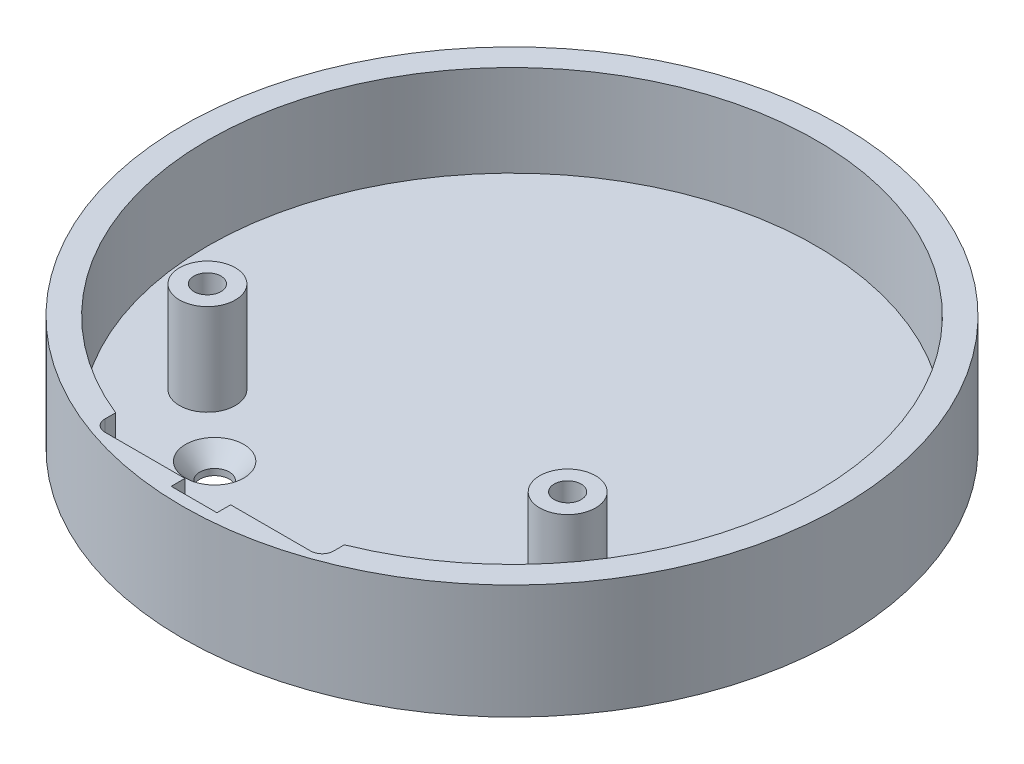
ISO-10303-21;
HEADER;
FILE_DESCRIPTION(('STEP AP214'),'2;1');
FILE_NAME('part.step','',(''),(''),'','','');
FILE_SCHEMA(('AUTOMOTIVE_DESIGN { 1 0 10303 214 1 1 1 1 }'));
ENDSEC;
DATA;
#1=APPLICATION_CONTEXT('core data for automotive mechanical design processes');
#2=APPLICATION_PROTOCOL_DEFINITION('international standard','automotive_design',2000,#1);
#3=PRODUCT_CONTEXT('',#1,'mechanical');
#4=PRODUCT('Part','Part','',(#3));
#5=PRODUCT_RELATED_PRODUCT_CATEGORY('part','',(#4));
#6=PRODUCT_DEFINITION_FORMATION('','',#4);
#7=PRODUCT_DEFINITION_CONTEXT('part definition',#1,'design');
#8=PRODUCT_DEFINITION('design','',#6,#7);
#9=PRODUCT_DEFINITION_SHAPE('','',#8);
#10=(LENGTH_UNIT() NAMED_UNIT(*) SI_UNIT(.MILLI.,.METRE.));
#11=(NAMED_UNIT(*) PLANE_ANGLE_UNIT() SI_UNIT($,.RADIAN.));
#12=(NAMED_UNIT(*) SI_UNIT($,.STERADIAN.) SOLID_ANGLE_UNIT());
#13=UNCERTAINTY_MEASURE_WITH_UNIT(LENGTH_MEASURE(1.E-05),#10,'distance_accuracy_value','');
#14=(GEOMETRIC_REPRESENTATION_CONTEXT(3) GLOBAL_UNCERTAINTY_ASSIGNED_CONTEXT((#13)) GLOBAL_UNIT_ASSIGNED_CONTEXT((#10,
#11,#12)) REPRESENTATION_CONTEXT('',''));
#15=CARTESIAN_POINT('',(0.,0.,0.));
#16=DIRECTION('',(0.,0.,1.));
#17=DIRECTION('',(1.,0.,0.));
#18=AXIS2_PLACEMENT_3D('',#15,#16,#17);
#19=CARTESIAN_POINT('',(-12.7,2.54,33.782));
#20=DIRECTION('',(0.,0.,-1.));
#21=DIRECTION('',(-1.,0.,0.));
#22=AXIS2_PLACEMENT_3D('',#19,#20,#21);
#23=PLANE('',#22);
#24=DIRECTION('',(1.,0.,0.));
#25=VECTOR('',#24,1.);
#26=CARTESIAN_POINT('',(-12.7,0.,33.782));
#27=LINE('',#26,#25);
#28=CARTESIAN_POINT('',(-11.43,0.,33.782));
#29=VERTEX_POINT('',#28);
#30=CARTESIAN_POINT('',(-2.54,0.,33.782));
#31=VERTEX_POINT('',#30);
#32=EDGE_CURVE('E185',#29,#31,#27,.T.);
#33=ORIENTED_EDGE('',*,*,#32,.F.);
#34=DIRECTION('',(0.,-1.,0.));
#35=VECTOR('',#34,1.);
#36=CARTESIAN_POINT('',(-11.43,12.7,33.782));
#37=LINE('',#36,#35);
#38=CARTESIAN_POINT('',(-11.43,12.7,33.782));
#39=VERTEX_POINT('',#38);
#40=EDGE_CURVE('E228',#29,#39,#37,.F.);
#41=ORIENTED_EDGE('',*,*,#40,.T.);
#42=DIRECTION('',(-1.,0.,0.));
#43=VECTOR('',#42,1.);
#44=CARTESIAN_POINT('',(-12.7,12.7,33.782));
#45=LINE('',#44,#43);
#46=CARTESIAN_POINT('',(-2.54,12.7,33.782));
#47=VERTEX_POINT('',#46);
#48=EDGE_CURVE('E305',#47,#39,#45,.T.);
#49=ORIENTED_EDGE('',*,*,#48,.F.);
#50=DIRECTION('',(0.,-1.,0.));
#51=VECTOR('',#50,1.);
#52=CARTESIAN_POINT('',(-2.54,12.7,33.782));
#53=LINE('',#52,#51);
#54=EDGE_CURVE('E316',#47,#31,#53,.T.);
#55=ORIENTED_EDGE('',*,*,#54,.T.);
#56=EDGE_LOOP('',(#33,#41,#49,#55));
#57=FACE_BOUND('',#56,.T.);
#58=ADVANCED_FACE('F45',(#57),#23,.T.);
#59=CARTESIAN_POINT('',(0.,2.54,0.));
#60=DIRECTION('',(0.,1.,0.));
#61=DIRECTION('',(0.,0.,1.));
#62=AXIS2_PLACEMENT_3D('',#59,#60,#61);
#63=PLANE('',#62);
#64=CARTESIAN_POINT('',(-12.7,2.54,20.32));
#65=DIRECTION('',(0.,1.,0.));
#66=DIRECTION('',(0.,0.,1.));
#67=AXIS2_PLACEMENT_3D('',#64,#65,#66);
#68=CIRCLE('',#67,3.2385);
#69=CARTESIAN_POINT('',(-12.7,2.54,23.5585));
#70=VERTEX_POINT('',#69);
#71=EDGE_CURVE('E322',#70,#70,#68,.T.);
#72=ORIENTED_EDGE('',*,*,#71,.F.);
#73=EDGE_LOOP('',(#72));
#74=FACE_BOUND('',#73,.T.);
#75=CARTESIAN_POINT('',(12.7,2.54,20.32));
#76=DIRECTION('',(0.,1.,0.));
#77=DIRECTION('',(0.,0.,1.));
#78=AXIS2_PLACEMENT_3D('',#75,#76,#77);
#79=CIRCLE('',#78,3.2385);
#80=CARTESIAN_POINT('',(12.7,2.54,23.5585));
#81=VERTEX_POINT('',#80);
#82=EDGE_CURVE('E364',#81,#81,#79,.T.);
#83=ORIENTED_EDGE('',*,*,#82,.F.);
#84=EDGE_LOOP('',(#83));
#85=FACE_BOUND('',#84,.T.);
#86=CARTESIAN_POINT('',(20.,2.54,13.82014));
#87=DIRECTION('',(0.,1.,0.));
#88=DIRECTION('',(0.,0.,1.));
#89=AXIS2_PLACEMENT_3D('',#86,#87,#88);
#90=CIRCLE('',#89,3.0999968);
#91=CARTESIAN_POINT('',(20.,2.54,16.9201368));
#92=VERTEX_POINT('',#91);
#93=EDGE_CURVE('E381',#92,#92,#90,.T.);
#94=ORIENTED_EDGE('',*,*,#93,.F.);
#95=EDGE_LOOP('',(#94));
#96=FACE_BOUND('',#95,.T.);
#97=CARTESIAN_POINT('',(-20.,2.54,13.82014));
#98=DIRECTION('',(0.,1.,0.));
#99=DIRECTION('',(0.,0.,1.));
#100=AXIS2_PLACEMENT_3D('',#97,#98,#99);
#101=CIRCLE('',#100,3.0999968);
#102=CARTESIAN_POINT('',(-20.,2.54,16.9201368));
#103=VERTEX_POINT('',#102);
#104=EDGE_CURVE('E293',#103,#103,#101,.T.);
#105=ORIENTED_EDGE('',*,*,#104,.F.);
#106=EDGE_LOOP('',(#105));
#107=FACE_BOUND('',#106,.T.);
#108=DIRECTION('',(0.,0.,-1.));
#109=VECTOR('',#108,1.);
#110=CARTESIAN_POINT('',(12.7,2.54,25.527));
#111=LINE('',#110,#109);
#112=CARTESIAN_POINT('',(12.7,2.54,31.3178106835392));
#113=VERTEX_POINT('',#112);
#114=CARTESIAN_POINT('',(12.7,2.54,26.797));
#115=VERTEX_POINT('',#114);
#116=EDGE_CURVE('E204',#113,#115,#111,.T.);
#117=ORIENTED_EDGE('',*,*,#116,.F.);
#118=CARTESIAN_POINT('',(0.,2.54,0.));
#119=DIRECTION('',(0.,1.,0.));
#120=DIRECTION('',(0.,0.,1.));
#121=AXIS2_PLACEMENT_3D('',#118,#119,#120);
#122=CIRCLE('',#121,33.7949);
#123=CARTESIAN_POINT('',(-12.7,2.54,31.3178106835392));
#124=VERTEX_POINT('',#123);
#125=EDGE_CURVE('E203',#113,#124,#122,.T.);
#126=ORIENTED_EDGE('',*,*,#125,.T.);
#127=DIRECTION('',(0.,0.,1.));
#128=VECTOR('',#127,1.);
#129=CARTESIAN_POINT('',(-12.7,2.54,25.527));
#130=LINE('',#129,#128);
#131=CARTESIAN_POINT('',(-12.7,2.54,26.797));
#132=VERTEX_POINT('',#131);
#133=EDGE_CURVE('E267',#132,#124,#130,.T.);
#134=ORIENTED_EDGE('',*,*,#133,.F.);
#135=CARTESIAN_POINT('',(-11.43,2.54,26.797));
#136=DIRECTION('',(0.,1.,0.));
#137=DIRECTION('',(0.,0.,1.));
#138=AXIS2_PLACEMENT_3D('',#135,#136,#137);
#139=CIRCLE('',#138,1.27);
#140=CARTESIAN_POINT('',(-11.43,2.54,25.527));
#141=VERTEX_POINT('',#140);
#142=EDGE_CURVE('E11',#132,#141,#139,.F.);
#143=ORIENTED_EDGE('',*,*,#142,.T.);
#144=DIRECTION('',(-1.,0.,0.));
#145=VECTOR('',#144,1.);
#146=CARTESIAN_POINT('',(-12.7,2.54,25.527));
#147=LINE('',#146,#145);
#148=CARTESIAN_POINT('',(11.43,2.54,25.527));
#149=VERTEX_POINT('',#148);
#150=EDGE_CURVE('E198',#149,#141,#147,.T.);
#151=ORIENTED_EDGE('',*,*,#150,.F.);
#152=CARTESIAN_POINT('',(11.43,2.54,26.797));
#153=DIRECTION('',(0.,1.,0.));
#154=DIRECTION('',(0.,0.,1.));
#155=AXIS2_PLACEMENT_3D('',#152,#153,#154);
#156=CIRCLE('',#155,1.27);
#157=EDGE_CURVE('E252',#149,#115,#156,.F.);
#158=ORIENTED_EDGE('',*,*,#157,.T.);
#159=EDGE_LOOP('',(#117,#126,#134,#143,#151,#158));
#160=FACE_BOUND('',#159,.T.);
#161=ADVANCED_FACE('F300',(#74,#85,#96,#107,#160),#63,.T.);
#162=CARTESIAN_POINT('',(0.,0.,0.));
#163=DIRECTION('',(0.,1.,0.));
#164=DIRECTION('',(0.,0.,1.));
#165=AXIS2_PLACEMENT_3D('',#162,#163,#164);
#166=PLANE('',#165);
#167=CARTESIAN_POINT('',(-12.7,0.,20.32));
#168=DIRECTION('',(0.,1.,0.));
#169=DIRECTION('',(0.,0.,1.));
#170=AXIS2_PLACEMENT_3D('',#167,#168,#169);
#171=CIRCLE('',#170,1.63195);
#172=CARTESIAN_POINT('',(-12.7,0.,21.95195));
#173=VERTEX_POINT('',#172);
#174=EDGE_CURVE('E360',#173,#173,#171,.T.);
#175=ORIENTED_EDGE('',*,*,#174,.T.);
#176=EDGE_LOOP('',(#175));
#177=FACE_BOUND('',#176,.T.);
#178=CARTESIAN_POINT('',(12.7,0.,20.32));
#179=DIRECTION('',(0.,1.,0.));
#180=DIRECTION('',(0.,0.,1.));
#181=AXIS2_PLACEMENT_3D('',#178,#179,#180);
#182=CIRCLE('',#181,1.63195);
#183=CARTESIAN_POINT('',(12.7,0.,21.95195));
#184=VERTEX_POINT('',#183);
#185=EDGE_CURVE('E372',#184,#184,#182,.T.);
#186=ORIENTED_EDGE('',*,*,#185,.T.);
#187=EDGE_LOOP('',(#186));
#188=FACE_BOUND('',#187,.T.);
#189=CARTESIAN_POINT('',(20.,0.,13.82014));
#190=DIRECTION('',(0.,1.,0.));
#191=DIRECTION('',(0.,0.,1.));
#192=AXIS2_PLACEMENT_3D('',#189,#190,#191);
#193=CIRCLE('',#192,1.5);
#194=CARTESIAN_POINT('',(20.,0.,15.32014));
#195=VERTEX_POINT('',#194);
#196=EDGE_CURVE('E377',#195,#195,#193,.T.);
#197=ORIENTED_EDGE('',*,*,#196,.T.);
#198=EDGE_LOOP('',(#197));
#199=FACE_BOUND('',#198,.T.);
#200=CARTESIAN_POINT('',(-20.,0.,13.82014));
#201=DIRECTION('',(0.,1.,0.));
#202=DIRECTION('',(0.,0.,1.));
#203=AXIS2_PLACEMENT_3D('',#200,#201,#202);
#204=CIRCLE('',#203,1.5);
#205=CARTESIAN_POINT('',(-20.,0.,15.32014));
#206=VERTEX_POINT('',#205);
#207=EDGE_CURVE('E386',#206,#206,#204,.T.);
#208=ORIENTED_EDGE('',*,*,#207,.T.);
#209=EDGE_LOOP('',(#208));
#210=FACE_BOUND('',#209,.T.);
#211=CARTESIAN_POINT('',(0.,0.,0.));
#212=DIRECTION('',(0.,1.,0.));
#213=DIRECTION('',(0.,0.,1.));
#214=AXIS2_PLACEMENT_3D('',#211,#212,#213);
#215=CIRCLE('',#214,36.5949);
#216=CARTESIAN_POINT('',(0.,0.,36.5949));
#217=VERTEX_POINT('',#216);
#218=EDGE_CURVE('E199',#217,#217,#215,.T.);
#219=ORIENTED_EDGE('',*,*,#218,.F.);
#220=EDGE_LOOP('',(#219));
#221=FACE_BOUND('',#220,.T.);
#222=DIRECTION('',(0.,0.,1.));
#223=VECTOR('',#222,1.);
#224=CARTESIAN_POINT('',(-12.7,0.,25.527));
#225=LINE('',#224,#223);
#226=CARTESIAN_POINT('',(-12.7,0.,26.797));
#227=VERTEX_POINT('',#226);
#228=CARTESIAN_POINT('',(-12.7,0.,32.512));
#229=VERTEX_POINT('',#228);
#230=EDGE_CURVE('E186',#227,#229,#225,.T.);
#231=ORIENTED_EDGE('',*,*,#230,.T.);
#232=CARTESIAN_POINT('',(-11.43,0.,32.512));
#233=DIRECTION('',(0.,1.,0.));
#234=DIRECTION('',(0.,0.,1.));
#235=AXIS2_PLACEMENT_3D('',#232,#233,#234);
#236=CIRCLE('',#235,1.27);
#237=EDGE_CURVE('E243',#229,#29,#236,.T.);
#238=ORIENTED_EDGE('',*,*,#237,.T.);
#239=ORIENTED_EDGE('',*,*,#32,.T.);
#240=DIRECTION('',(0.,0.,-1.));
#241=VECTOR('',#240,1.);
#242=CARTESIAN_POINT('',(-2.54,0.,35.3036449394393));
#243=LINE('',#242,#241);
#244=CARTESIAN_POINT('',(-2.54,0.,35.3036449394393));
#245=VERTEX_POINT('',#244);
#246=EDGE_CURVE('E325',#245,#31,#243,.T.);
#247=ORIENTED_EDGE('',*,*,#246,.F.);
#248=DIRECTION('',(-1.,0.,0.));
#249=VECTOR('',#248,1.);
#250=CARTESIAN_POINT('',(-2.54,0.,35.3036449394393));
#251=LINE('',#250,#249);
#252=CARTESIAN_POINT('',(2.54,0.,35.3036449394393));
#253=VERTEX_POINT('',#252);
#254=EDGE_CURVE('E177',#253,#245,#251,.T.);
#255=ORIENTED_EDGE('',*,*,#254,.F.);
#256=DIRECTION('',(0.,0.,1.));
#257=VECTOR('',#256,1.);
#258=CARTESIAN_POINT('',(2.54,0.,35.3036449394393));
#259=LINE('',#258,#257);
#260=CARTESIAN_POINT('',(2.54,0.,33.782));
#261=VERTEX_POINT('',#260);
#262=EDGE_CURVE('E159',#261,#253,#259,.T.);
#263=ORIENTED_EDGE('',*,*,#262,.F.);
#264=CARTESIAN_POINT('',(11.43,0.,33.782));
#265=VERTEX_POINT('',#264);
#266=EDGE_CURVE('E174',#261,#265,#27,.T.);
#267=ORIENTED_EDGE('',*,*,#266,.T.);
#268=CARTESIAN_POINT('',(11.43,0.,32.512));
#269=DIRECTION('',(0.,1.,0.));
#270=DIRECTION('',(0.,0.,1.));
#271=AXIS2_PLACEMENT_3D('',#268,#269,#270);
#272=CIRCLE('',#271,1.27);
#273=CARTESIAN_POINT('',(12.7,0.,32.512));
#274=VERTEX_POINT('',#273);
#275=EDGE_CURVE('E237',#265,#274,#272,.T.);
#276=ORIENTED_EDGE('',*,*,#275,.T.);
#277=DIRECTION('',(0.,0.,-1.));
#278=VECTOR('',#277,1.);
#279=CARTESIAN_POINT('',(12.7,0.,25.527));
#280=LINE('',#279,#278);
#281=CARTESIAN_POINT('',(12.7,0.,26.797));
#282=VERTEX_POINT('',#281);
#283=EDGE_CURVE('E190',#274,#282,#280,.T.);
#284=ORIENTED_EDGE('',*,*,#283,.T.);
#285=CARTESIAN_POINT('',(11.43,0.,26.797));
#286=DIRECTION('',(0.,1.,0.));
#287=DIRECTION('',(0.,0.,1.));
#288=AXIS2_PLACEMENT_3D('',#285,#286,#287);
#289=CIRCLE('',#288,1.27);
#290=CARTESIAN_POINT('',(11.43,0.,25.527));
#291=VERTEX_POINT('',#290);
#292=EDGE_CURVE('E249',#282,#291,#289,.T.);
#293=ORIENTED_EDGE('',*,*,#292,.T.);
#294=DIRECTION('',(-1.,0.,0.));
#295=VECTOR('',#294,1.);
#296=CARTESIAN_POINT('',(-12.7,0.,25.527));
#297=LINE('',#296,#295);
#298=CARTESIAN_POINT('',(-11.43,0.,25.527));
#299=VERTEX_POINT('',#298);
#300=EDGE_CURVE('E191',#291,#299,#297,.T.);
#301=ORIENTED_EDGE('',*,*,#300,.T.);
#302=CARTESIAN_POINT('',(-11.43,0.,26.797));
#303=DIRECTION('',(0.,1.,0.));
#304=DIRECTION('',(0.,0.,1.));
#305=AXIS2_PLACEMENT_3D('',#302,#303,#304);
#306=CIRCLE('',#305,1.27);
#307=EDGE_CURVE('E54',#299,#227,#306,.T.);
#308=ORIENTED_EDGE('',*,*,#307,.T.);
#309=EDGE_LOOP('',(#231,#238,#239,#247,#255,#263,#267,#276,#284,#293,#301,#308));
#310=FACE_BOUND('',#309,.T.);
#311=ADVANCED_FACE('F173',(#177,#188,#199,#210,#221,#310),#166,.F.);
#312=CARTESIAN_POINT('',(0.,2.54,0.));
#313=DIRECTION('',(0.,-1.,0.));
#314=DIRECTION('',(0.,0.,-1.));
#315=AXIS2_PLACEMENT_3D('',#312,#313,#314);
#316=CYLINDRICAL_SURFACE('',#315,36.5949);
#317=ORIENTED_EDGE('',*,*,#218,.T.);
#318=EDGE_LOOP('',(#317));
#319=FACE_BOUND('',#318,.T.);
#320=CARTESIAN_POINT('',(0.,12.7,0.));
#321=DIRECTION('',(0.,1.,0.));
#322=DIRECTION('',(0.,0.,1.));
#323=AXIS2_PLACEMENT_3D('',#320,#321,#322);
#324=CIRCLE('',#323,36.5949);
#325=CARTESIAN_POINT('',(0.,12.7,36.5949));
#326=VERTEX_POINT('',#325);
#327=EDGE_CURVE('E272',#326,#326,#324,.T.);
#328=ORIENTED_EDGE('',*,*,#327,.F.);
#329=EDGE_LOOP('',(#328));
#330=FACE_BOUND('',#329,.T.);
#331=ADVANCED_FACE('F413',(#319,#330),#316,.T.);
#332=CARTESIAN_POINT('',(-12.7,2.54,25.527));
#333=DIRECTION('',(0.,0.,1.));
#334=DIRECTION('',(1.,0.,0.));
#335=AXIS2_PLACEMENT_3D('',#332,#333,#334);
#336=PLANE('',#335);
#337=ORIENTED_EDGE('',*,*,#300,.F.);
#338=DIRECTION('',(0.,-1.,0.));
#339=VECTOR('',#338,1.);
#340=CARTESIAN_POINT('',(11.43,2.54,25.527));
#341=LINE('',#340,#339);
#342=EDGE_CURVE('E66',#291,#149,#341,.F.);
#343=ORIENTED_EDGE('',*,*,#342,.T.);
#344=ORIENTED_EDGE('',*,*,#150,.T.);
#345=DIRECTION('',(0.,-1.,0.));
#346=VECTOR('',#345,1.);
#347=CARTESIAN_POINT('',(-11.43,0.,25.527));
#348=LINE('',#347,#346);
#349=EDGE_CURVE('E231',#141,#299,#348,.T.);
#350=ORIENTED_EDGE('',*,*,#349,.T.);
#351=EDGE_LOOP('',(#337,#343,#344,#350));
#352=FACE_BOUND('',#351,.T.);
#353=ADVANCED_FACE('F264',(#352),#336,.T.);
#354=CARTESIAN_POINT('',(-12.7,2.54,25.527));
#355=DIRECTION('',(1.,0.,0.));
#356=DIRECTION('',(0.,0.,-1.));
#357=AXIS2_PLACEMENT_3D('',#354,#355,#356);
#358=PLANE('',#357);
#359=DIRECTION('',(0.,0.,-1.));
#360=VECTOR('',#359,1.);
#361=CARTESIAN_POINT('',(-12.7,12.7,25.527));
#362=LINE('',#361,#360);
#363=CARTESIAN_POINT('',(-12.7,12.7,32.512));
#364=VERTEX_POINT('',#363);
#365=CARTESIAN_POINT('',(-12.7,12.7,31.3178106835392));
#366=VERTEX_POINT('',#365);
#367=EDGE_CURVE('E302',#364,#366,#362,.T.);
#368=ORIENTED_EDGE('',*,*,#367,.F.);
#369=DIRECTION('',(0.,-1.,0.));
#370=VECTOR('',#369,1.);
#371=CARTESIAN_POINT('',(-12.7,0.,32.512));
#372=LINE('',#371,#370);
#373=EDGE_CURVE('E224',#364,#229,#372,.T.);
#374=ORIENTED_EDGE('',*,*,#373,.T.);
#375=ORIENTED_EDGE('',*,*,#230,.F.);
#376=DIRECTION('',(0.,-1.,0.));
#377=VECTOR('',#376,1.);
#378=CARTESIAN_POINT('',(-12.7,2.54,26.797));
#379=LINE('',#378,#377);
#380=EDGE_CURVE('E221',#227,#132,#379,.F.);
#381=ORIENTED_EDGE('',*,*,#380,.T.);
#382=ORIENTED_EDGE('',*,*,#133,.T.);
#383=DIRECTION('',(0.,-1.,0.));
#384=VECTOR('',#383,1.);
#385=CARTESIAN_POINT('',(-12.7,12.7,31.3178106835392));
#386=LINE('',#385,#384);
#387=EDGE_CURVE('E205',#124,#366,#386,.F.);
#388=ORIENTED_EDGE('',*,*,#387,.T.);
#389=EDGE_LOOP('',(#368,#374,#375,#381,#382,#388));
#390=FACE_BOUND('',#389,.T.);
#391=ADVANCED_FACE('F262',(#390),#358,.T.);
#392=DIRECTION('',(-1.,0.,0.));
#393=VECTOR('',#392,1.);
#394=CARTESIAN_POINT('',(2.54,12.7,33.782));
#395=LINE('',#394,#393);
#396=CARTESIAN_POINT('',(11.43,12.7,33.782));
#397=VERTEX_POINT('',#396);
#398=CARTESIAN_POINT('',(2.54,12.7,33.782));
#399=VERTEX_POINT('',#398);
#400=EDGE_CURVE('E328',#397,#399,#395,.T.);
#401=ORIENTED_EDGE('',*,*,#400,.F.);
#402=DIRECTION('',(0.,-1.,0.));
#403=VECTOR('',#402,1.);
#404=CARTESIAN_POINT('',(11.43,0.,33.782));
#405=LINE('',#404,#403);
#406=EDGE_CURVE('E183',#397,#265,#405,.T.);
#407=ORIENTED_EDGE('',*,*,#406,.T.);
#408=ORIENTED_EDGE('',*,*,#266,.F.);
#409=DIRECTION('',(0.,-1.,0.));
#410=VECTOR('',#409,1.);
#411=CARTESIAN_POINT('',(2.54,12.7,33.782));
#412=LINE('',#411,#410);
#413=EDGE_CURVE('E156',#399,#261,#412,.T.);
#414=ORIENTED_EDGE('',*,*,#413,.F.);
#415=EDGE_LOOP('',(#401,#407,#408,#414));
#416=FACE_BOUND('',#415,.T.);
#417=ADVANCED_FACE('F181',(#416),#23,.T.);
#418=CARTESIAN_POINT('',(12.7,2.54,25.527));
#419=DIRECTION('',(-1.,0.,0.));
#420=DIRECTION('',(0.,0.,1.));
#421=AXIS2_PLACEMENT_3D('',#418,#419,#420);
#422=PLANE('',#421);
#423=ORIENTED_EDGE('',*,*,#283,.F.);
#424=DIRECTION('',(0.,-1.,0.));
#425=VECTOR('',#424,1.);
#426=CARTESIAN_POINT('',(12.7,12.7,32.512));
#427=LINE('',#426,#425);
#428=CARTESIAN_POINT('',(12.7,12.7,32.512));
#429=VERTEX_POINT('',#428);
#430=EDGE_CURVE('E218',#274,#429,#427,.F.);
#431=ORIENTED_EDGE('',*,*,#430,.T.);
#432=DIRECTION('',(0.,0.,1.));
#433=VECTOR('',#432,1.);
#434=CARTESIAN_POINT('',(12.7,12.7,33.782));
#435=LINE('',#434,#433);
#436=CARTESIAN_POINT('',(12.7,12.7,31.3178106835392));
#437=VERTEX_POINT('',#436);
#438=EDGE_CURVE('E168',#437,#429,#435,.T.);
#439=ORIENTED_EDGE('',*,*,#438,.F.);
#440=DIRECTION('',(0.,-1.,0.));
#441=VECTOR('',#440,1.);
#442=CARTESIAN_POINT('',(12.7,12.7,31.3178106835392));
#443=LINE('',#442,#441);
#444=EDGE_CURVE('E209',#437,#113,#443,.T.);
#445=ORIENTED_EDGE('',*,*,#444,.T.);
#446=ORIENTED_EDGE('',*,*,#116,.T.);
#447=DIRECTION('',(0.,-1.,0.));
#448=VECTOR('',#447,1.);
#449=CARTESIAN_POINT('',(12.7,0.,26.797));
#450=LINE('',#449,#448);
#451=EDGE_CURVE('E214',#115,#282,#450,.T.);
#452=ORIENTED_EDGE('',*,*,#451,.T.);
#453=EDGE_LOOP('',(#423,#431,#439,#445,#446,#452));
#454=FACE_BOUND('',#453,.T.);
#455=ADVANCED_FACE('F439',(#454),#422,.T.);
#456=CARTESIAN_POINT('',(0.,12.7,0.));
#457=DIRECTION('',(0.,1.,0.));
#458=DIRECTION('',(0.,0.,1.));
#459=AXIS2_PLACEMENT_3D('',#456,#457,#458);
#460=PLANE('',#459);
#461=ORIENTED_EDGE('',*,*,#438,.T.);
#462=CARTESIAN_POINT('',(11.43,12.7,32.512));
#463=DIRECTION('',(0.,1.,0.));
#464=DIRECTION('',(0.,0.,1.));
#465=AXIS2_PLACEMENT_3D('',#462,#463,#464);
#466=CIRCLE('',#465,1.27);
#467=EDGE_CURVE('E240',#429,#397,#466,.F.);
#468=ORIENTED_EDGE('',*,*,#467,.T.);
#469=ORIENTED_EDGE('',*,*,#400,.T.);
#470=DIRECTION('',(0.,0.,1.));
#471=VECTOR('',#470,1.);
#472=CARTESIAN_POINT('',(2.54,12.7,35.3036449394393));
#473=LINE('',#472,#471);
#474=CARTESIAN_POINT('',(2.54,12.7,35.3036449394393));
#475=VERTEX_POINT('',#474);
#476=EDGE_CURVE('E162',#399,#475,#473,.T.);
#477=ORIENTED_EDGE('',*,*,#476,.T.);
#478=DIRECTION('',(-1.,0.,0.));
#479=VECTOR('',#478,1.);
#480=CARTESIAN_POINT('',(-2.54,12.7,35.3036449394393));
#481=LINE('',#480,#479);
#482=CARTESIAN_POINT('',(-2.54,12.7,35.3036449394393));
#483=VERTEX_POINT('',#482);
#484=EDGE_CURVE('E337',#475,#483,#481,.T.);
#485=ORIENTED_EDGE('',*,*,#484,.T.);
#486=DIRECTION('',(0.,0.,-1.));
#487=VECTOR('',#486,1.);
#488=CARTESIAN_POINT('',(-2.54,12.7,35.3036449394393));
#489=LINE('',#488,#487);
#490=EDGE_CURVE('E341',#483,#47,#489,.T.);
#491=ORIENTED_EDGE('',*,*,#490,.T.);
#492=ORIENTED_EDGE('',*,*,#48,.T.);
#493=CARTESIAN_POINT('',(-11.43,12.7,32.512));
#494=DIRECTION('',(0.,1.,0.));
#495=DIRECTION('',(0.,0.,1.));
#496=AXIS2_PLACEMENT_3D('',#493,#494,#495);
#497=CIRCLE('',#496,1.27);
#498=EDGE_CURVE('E246',#39,#364,#497,.F.);
#499=ORIENTED_EDGE('',*,*,#498,.T.);
#500=ORIENTED_EDGE('',*,*,#367,.T.);
#501=CARTESIAN_POINT('',(0.,12.7,0.));
#502=DIRECTION('',(0.,1.,0.));
#503=DIRECTION('',(0.,0.,1.));
#504=AXIS2_PLACEMENT_3D('',#501,#502,#503);
#505=CIRCLE('',#504,33.7949);
#506=EDGE_CURVE('E280',#437,#366,#505,.T.);
#507=ORIENTED_EDGE('',*,*,#506,.F.);
#508=EDGE_LOOP('',(#461,#468,#469,#477,#485,#491,#492,#499,#500,#507));
#509=FACE_BOUND('',#508,.T.);
#510=ORIENTED_EDGE('',*,*,#327,.T.);
#511=EDGE_LOOP('',(#510));
#512=FACE_BOUND('',#511,.T.);
#513=ADVANCED_FACE('F442',(#509,#512),#460,.T.);
#514=CARTESIAN_POINT('',(0.,12.7,0.));
#515=DIRECTION('',(0.,-1.,0.));
#516=DIRECTION('',(0.,0.,-1.));
#517=AXIS2_PLACEMENT_3D('',#514,#515,#516);
#518=CYLINDRICAL_SURFACE('',#517,33.7949);
#519=ORIENTED_EDGE('',*,*,#444,.F.);
#520=ORIENTED_EDGE('',*,*,#506,.T.);
#521=ORIENTED_EDGE('',*,*,#387,.F.);
#522=ORIENTED_EDGE('',*,*,#125,.F.);
#523=EDGE_LOOP('',(#519,#520,#521,#522));
#524=FACE_BOUND('',#523,.T.);
#525=ADVANCED_FACE('F301',(#524),#518,.F.);
#526=CARTESIAN_POINT('',(-20.,21.4681150357464,13.82014));
#527=DIRECTION('',(0.,-1.,0.));
#528=DIRECTION('',(0.,0.,-1.));
#529=AXIS2_PLACEMENT_3D('',#526,#527,#528);
#530=CYLINDRICAL_SURFACE('',#529,3.0999968);
#531=ORIENTED_EDGE('',*,*,#104,.T.);
#532=EDGE_LOOP('',(#531));
#533=FACE_BOUND('',#532,.T.);
#534=CARTESIAN_POINT('',(-20.,12.7,13.82014));
#535=DIRECTION('',(0.,1.,0.));
#536=DIRECTION('',(0.,0.,1.));
#537=AXIS2_PLACEMENT_3D('',#534,#535,#536);
#538=CIRCLE('',#537,3.0999968);
#539=CARTESIAN_POINT('',(-20.,12.7,16.9201368));
#540=VERTEX_POINT('',#539);
#541=EDGE_CURVE('E285',#540,#540,#538,.T.);
#542=ORIENTED_EDGE('',*,*,#541,.F.);
#543=EDGE_LOOP('',(#542));
#544=FACE_BOUND('',#543,.T.);
#545=ADVANCED_FACE('F403',(#533,#544),#530,.T.);
#546=CARTESIAN_POINT('',(0.,12.7,0.));
#547=DIRECTION('',(0.,1.,0.));
#548=DIRECTION('',(0.,0.,1.));
#549=AXIS2_PLACEMENT_3D('',#546,#547,#548);
#550=PLANE('',#549);
#551=CARTESIAN_POINT('',(-20.,12.7,13.82014));
#552=DIRECTION('',(0.,1.,0.));
#553=DIRECTION('',(0.,0.,1.));
#554=AXIS2_PLACEMENT_3D('',#551,#552,#553);
#555=CIRCLE('',#554,1.5);
#556=CARTESIAN_POINT('',(-20.,12.7,15.32014));
#557=VERTEX_POINT('',#556);
#558=EDGE_CURVE('E376',#557,#557,#555,.T.);
#559=ORIENTED_EDGE('',*,*,#558,.F.);
#560=EDGE_LOOP('',(#559));
#561=FACE_BOUND('',#560,.T.);
#562=ORIENTED_EDGE('',*,*,#541,.T.);
#563=EDGE_LOOP('',(#562));
#564=FACE_BOUND('',#563,.T.);
#565=ADVANCED_FACE('F483',(#561,#564),#550,.T.);
#566=CARTESIAN_POINT('',(20.,21.4681150357464,13.82014));
#567=DIRECTION('',(0.,-1.,0.));
#568=DIRECTION('',(0.,0.,-1.));
#569=AXIS2_PLACEMENT_3D('',#566,#567,#568);
#570=CYLINDRICAL_SURFACE('',#569,3.0999968);
#571=ORIENTED_EDGE('',*,*,#93,.T.);
#572=EDGE_LOOP('',(#571));
#573=FACE_BOUND('',#572,.T.);
#574=CARTESIAN_POINT('',(20.,12.7,13.82014));
#575=DIRECTION('',(0.,1.,0.));
#576=DIRECTION('',(0.,0.,1.));
#577=AXIS2_PLACEMENT_3D('',#574,#575,#576);
#578=CIRCLE('',#577,3.0999968);
#579=CARTESIAN_POINT('',(20.,12.7,16.9201368));
#580=VERTEX_POINT('',#579);
#581=EDGE_CURVE('E396',#580,#580,#578,.T.);
#582=ORIENTED_EDGE('',*,*,#581,.F.);
#583=EDGE_LOOP('',(#582));
#584=FACE_BOUND('',#583,.T.);
#585=ADVANCED_FACE('F480',(#573,#584),#570,.T.);
#586=CARTESIAN_POINT('',(0.,12.7,0.));
#587=DIRECTION('',(0.,1.,0.));
#588=DIRECTION('',(0.,0.,1.));
#589=AXIS2_PLACEMENT_3D('',#586,#587,#588);
#590=PLANE('',#589);
#591=CARTESIAN_POINT('',(20.,12.7,13.82014));
#592=DIRECTION('',(0.,1.,0.));
#593=DIRECTION('',(0.,0.,1.));
#594=AXIS2_PLACEMENT_3D('',#591,#592,#593);
#595=CIRCLE('',#594,1.5);
#596=CARTESIAN_POINT('',(20.,12.7,15.32014));
#597=VERTEX_POINT('',#596);
#598=EDGE_CURVE('E382',#597,#597,#595,.T.);
#599=ORIENTED_EDGE('',*,*,#598,.F.);
#600=EDGE_LOOP('',(#599));
#601=FACE_BOUND('',#600,.T.);
#602=ORIENTED_EDGE('',*,*,#581,.T.);
#603=EDGE_LOOP('',(#602));
#604=FACE_BOUND('',#603,.T.);
#605=ADVANCED_FACE('F475',(#601,#604),#590,.T.);
#606=CARTESIAN_POINT('',(20.,0.,13.82014));
#607=DIRECTION('',(0.,1.,0.));
#608=DIRECTION('',(0.,0.,1.));
#609=AXIS2_PLACEMENT_3D('',#606,#607,#608);
#610=CYLINDRICAL_SURFACE('',#609,1.5);
#611=ORIENTED_EDGE('',*,*,#196,.F.);
#612=EDGE_LOOP('',(#611));
#613=FACE_BOUND('',#612,.T.);
#614=ORIENTED_EDGE('',*,*,#598,.T.);
#615=EDGE_LOOP('',(#614));
#616=FACE_BOUND('',#615,.T.);
#617=ADVANCED_FACE('F472',(#613,#616),#610,.F.);
#618=CARTESIAN_POINT('',(-20.,0.,13.82014));
#619=DIRECTION('',(0.,1.,0.));
#620=DIRECTION('',(0.,0.,1.));
#621=AXIS2_PLACEMENT_3D('',#618,#619,#620);
#622=CYLINDRICAL_SURFACE('',#621,1.5);
#623=ORIENTED_EDGE('',*,*,#207,.F.);
#624=EDGE_LOOP('',(#623));
#625=FACE_BOUND('',#624,.T.);
#626=ORIENTED_EDGE('',*,*,#558,.T.);
#627=EDGE_LOOP('',(#626));
#628=FACE_BOUND('',#627,.T.);
#629=ADVANCED_FACE('F470',(#625,#628),#622,.F.);
#630=CARTESIAN_POINT('',(12.7,2.54,20.32));
#631=DIRECTION('',(0.,1.,0.));
#632=DIRECTION('',(0.,0.,1.));
#633=AXIS2_PLACEMENT_3D('',#630,#631,#632);
#634=CYLINDRICAL_SURFACE('',#633,1.63195);
#635=ORIENTED_EDGE('',*,*,#185,.F.);
#636=EDGE_LOOP('',(#635));
#637=FACE_BOUND('',#636,.T.);
#638=CARTESIAN_POINT('',(12.7,0.691875635379085,20.32));
#639=DIRECTION('',(0.,1.,0.));
#640=DIRECTION('',(0.,0.,1.));
#641=AXIS2_PLACEMENT_3D('',#638,#639,#640);
#642=CIRCLE('',#641,1.63195);
#643=CARTESIAN_POINT('',(12.7,0.691875635379085,21.95195));
#644=VERTEX_POINT('',#643);
#645=EDGE_CURVE('E368',#644,#644,#642,.T.);
#646=ORIENTED_EDGE('',*,*,#645,.T.);
#647=EDGE_LOOP('',(#646));
#648=FACE_BOUND('',#647,.T.);
#649=ADVANCED_FACE('F466',(#637,#648),#634,.F.);
#650=CARTESIAN_POINT('',(12.7,2.54,20.32));
#651=DIRECTION('',(0.,1.,0.));
#652=DIRECTION('',(0.,0.,1.));
#653=AXIS2_PLACEMENT_3D('',#650,#651,#652);
#654=CONICAL_SURFACE('',#653,3.2385,0.715584993317675);
#655=ORIENTED_EDGE('',*,*,#645,.F.);
#656=EDGE_LOOP('',(#655));
#657=FACE_BOUND('',#656,.T.);
#658=ORIENTED_EDGE('',*,*,#82,.T.);
#659=EDGE_LOOP('',(#658));
#660=FACE_BOUND('',#659,.T.);
#661=ADVANCED_FACE('F462',(#657,#660),#654,.F.);
#662=CARTESIAN_POINT('',(-12.7,2.54,20.32));
#663=DIRECTION('',(0.,1.,0.));
#664=DIRECTION('',(0.,0.,1.));
#665=AXIS2_PLACEMENT_3D('',#662,#663,#664);
#666=CYLINDRICAL_SURFACE('',#665,1.63195);
#667=ORIENTED_EDGE('',*,*,#174,.F.);
#668=EDGE_LOOP('',(#667));
#669=FACE_BOUND('',#668,.T.);
#670=CARTESIAN_POINT('',(-12.7,0.691875635379085,20.32));
#671=DIRECTION('',(0.,1.,0.));
#672=DIRECTION('',(0.,0.,1.));
#673=AXIS2_PLACEMENT_3D('',#670,#671,#672);
#674=CIRCLE('',#673,1.63195);
#675=CARTESIAN_POINT('',(-12.7,0.691875635379085,21.95195));
#676=VERTEX_POINT('',#675);
#677=EDGE_CURVE('E356',#676,#676,#674,.T.);
#678=ORIENTED_EDGE('',*,*,#677,.T.);
#679=EDGE_LOOP('',(#678));
#680=FACE_BOUND('',#679,.T.);
#681=ADVANCED_FACE('F458',(#669,#680),#666,.F.);
#682=CARTESIAN_POINT('',(-12.7,2.54,20.32));
#683=DIRECTION('',(0.,1.,0.));
#684=DIRECTION('',(0.,0.,1.));
#685=AXIS2_PLACEMENT_3D('',#682,#683,#684);
#686=CONICAL_SURFACE('',#685,3.2385,0.715584993317675);
#687=ORIENTED_EDGE('',*,*,#677,.F.);
#688=EDGE_LOOP('',(#687));
#689=FACE_BOUND('',#688,.T.);
#690=ORIENTED_EDGE('',*,*,#71,.T.);
#691=EDGE_LOOP('',(#690));
#692=FACE_BOUND('',#691,.T.);
#693=ADVANCED_FACE('F453',(#689,#692),#686,.F.);
#694=CARTESIAN_POINT('',(-2.54,12.7,35.3036449394393));
#695=DIRECTION('',(-1.,0.,0.));
#696=DIRECTION('',(0.,0.,1.));
#697=AXIS2_PLACEMENT_3D('',#694,#695,#696);
#698=PLANE('',#697);
#699=ORIENTED_EDGE('',*,*,#54,.F.);
#700=ORIENTED_EDGE('',*,*,#490,.F.);
#701=DIRECTION('',(0.,-1.,0.));
#702=VECTOR('',#701,1.);
#703=CARTESIAN_POINT('',(-2.54,12.7,35.3036449394393));
#704=LINE('',#703,#702);
#705=EDGE_CURVE('E323',#483,#245,#704,.T.);
#706=ORIENTED_EDGE('',*,*,#705,.T.);
#707=ORIENTED_EDGE('',*,*,#246,.T.);
#708=EDGE_LOOP('',(#699,#700,#706,#707));
#709=FACE_BOUND('',#708,.T.);
#710=ADVANCED_FACE('F326',(#709),#698,.F.);
#711=CARTESIAN_POINT('',(-2.54,12.7,35.3036449394393));
#712=DIRECTION('',(0.,0.,1.));
#713=DIRECTION('',(1.,0.,0.));
#714=AXIS2_PLACEMENT_3D('',#711,#712,#713);
#715=PLANE('',#714);
#716=ORIENTED_EDGE('',*,*,#705,.F.);
#717=ORIENTED_EDGE('',*,*,#484,.F.);
#718=DIRECTION('',(0.,-1.,0.));
#719=VECTOR('',#718,1.);
#720=CARTESIAN_POINT('',(2.54,12.7,35.3036449394393));
#721=LINE('',#720,#719);
#722=EDGE_CURVE('E167',#475,#253,#721,.T.);
#723=ORIENTED_EDGE('',*,*,#722,.T.);
#724=ORIENTED_EDGE('',*,*,#254,.T.);
#725=EDGE_LOOP('',(#716,#717,#723,#724));
#726=FACE_BOUND('',#725,.T.);
#727=ADVANCED_FACE('F445',(#726),#715,.F.);
#728=CARTESIAN_POINT('',(2.54,12.7,35.3036449394393));
#729=DIRECTION('',(1.,0.,0.));
#730=DIRECTION('',(0.,0.,-1.));
#731=AXIS2_PLACEMENT_3D('',#728,#729,#730);
#732=PLANE('',#731);
#733=ORIENTED_EDGE('',*,*,#722,.F.);
#734=ORIENTED_EDGE('',*,*,#476,.F.);
#735=ORIENTED_EDGE('',*,*,#413,.T.);
#736=ORIENTED_EDGE('',*,*,#262,.T.);
#737=EDGE_LOOP('',(#733,#734,#735,#736));
#738=FACE_BOUND('',#737,.T.);
#739=ADVANCED_FACE('F158',(#738),#732,.F.);
#740=CARTESIAN_POINT('',(11.43,2.54,32.512));
#741=DIRECTION('',(0.,1.,0.));
#742=DIRECTION('',(0.,0.,1.));
#743=AXIS2_PLACEMENT_3D('',#740,#741,#742);
#744=CYLINDRICAL_SURFACE('',#743,1.27);
#745=ORIENTED_EDGE('',*,*,#467,.F.);
#746=ORIENTED_EDGE('',*,*,#430,.F.);
#747=ORIENTED_EDGE('',*,*,#275,.F.);
#748=ORIENTED_EDGE('',*,*,#406,.F.);
#749=EDGE_LOOP('',(#745,#746,#747,#748));
#750=FACE_BOUND('',#749,.T.);
#751=ADVANCED_FACE('F425',(#750),#744,.F.);
#752=CARTESIAN_POINT('',(-11.43,2.54,32.512));
#753=DIRECTION('',(0.,1.,0.));
#754=DIRECTION('',(0.,0.,1.));
#755=AXIS2_PLACEMENT_3D('',#752,#753,#754);
#756=CYLINDRICAL_SURFACE('',#755,1.27);
#757=ORIENTED_EDGE('',*,*,#498,.F.);
#758=ORIENTED_EDGE('',*,*,#40,.F.);
#759=ORIENTED_EDGE('',*,*,#237,.F.);
#760=ORIENTED_EDGE('',*,*,#373,.F.);
#761=EDGE_LOOP('',(#757,#758,#759,#760));
#762=FACE_BOUND('',#761,.T.);
#763=ADVANCED_FACE('F309',(#762),#756,.F.);
#764=CARTESIAN_POINT('',(11.43,2.54,26.797));
#765=DIRECTION('',(0.,1.,0.));
#766=DIRECTION('',(0.,0.,1.));
#767=AXIS2_PLACEMENT_3D('',#764,#765,#766);
#768=CYLINDRICAL_SURFACE('',#767,1.27);
#769=ORIENTED_EDGE('',*,*,#157,.F.);
#770=ORIENTED_EDGE('',*,*,#342,.F.);
#771=ORIENTED_EDGE('',*,*,#292,.F.);
#772=ORIENTED_EDGE('',*,*,#451,.F.);
#773=EDGE_LOOP('',(#769,#770,#771,#772));
#774=FACE_BOUND('',#773,.T.);
#775=ADVANCED_FACE('F430',(#774),#768,.F.);
#776=CARTESIAN_POINT('',(-11.43,2.54,26.797));
#777=DIRECTION('',(0.,1.,0.));
#778=DIRECTION('',(0.,0.,1.));
#779=AXIS2_PLACEMENT_3D('',#776,#777,#778);
#780=CYLINDRICAL_SURFACE('',#779,1.27);
#781=ORIENTED_EDGE('',*,*,#142,.F.);
#782=ORIENTED_EDGE('',*,*,#380,.F.);
#783=ORIENTED_EDGE('',*,*,#307,.F.);
#784=ORIENTED_EDGE('',*,*,#349,.F.);
#785=EDGE_LOOP('',(#781,#782,#783,#784));
#786=FACE_BOUND('',#785,.T.);
#787=ADVANCED_FACE('F47',(#786),#780,.F.);
#788=CLOSED_SHELL('',(#58,#161,#311,#331,#353,#391,#417,#455,#513,#525,#545,#565,#585,#605,#617,
#629,#649,#661,#681,#693,#710,#727,#739,#751,#763,#775,#787));
#789=MANIFOLD_SOLID_BREP('B2',#788);
#790=ADVANCED_BREP_SHAPE_REPRESENTATION('',(#18,#789),#14);
#791=SHAPE_DEFINITION_REPRESENTATION(#9,#790);
ENDSEC;
END-ISO-10303-21;
